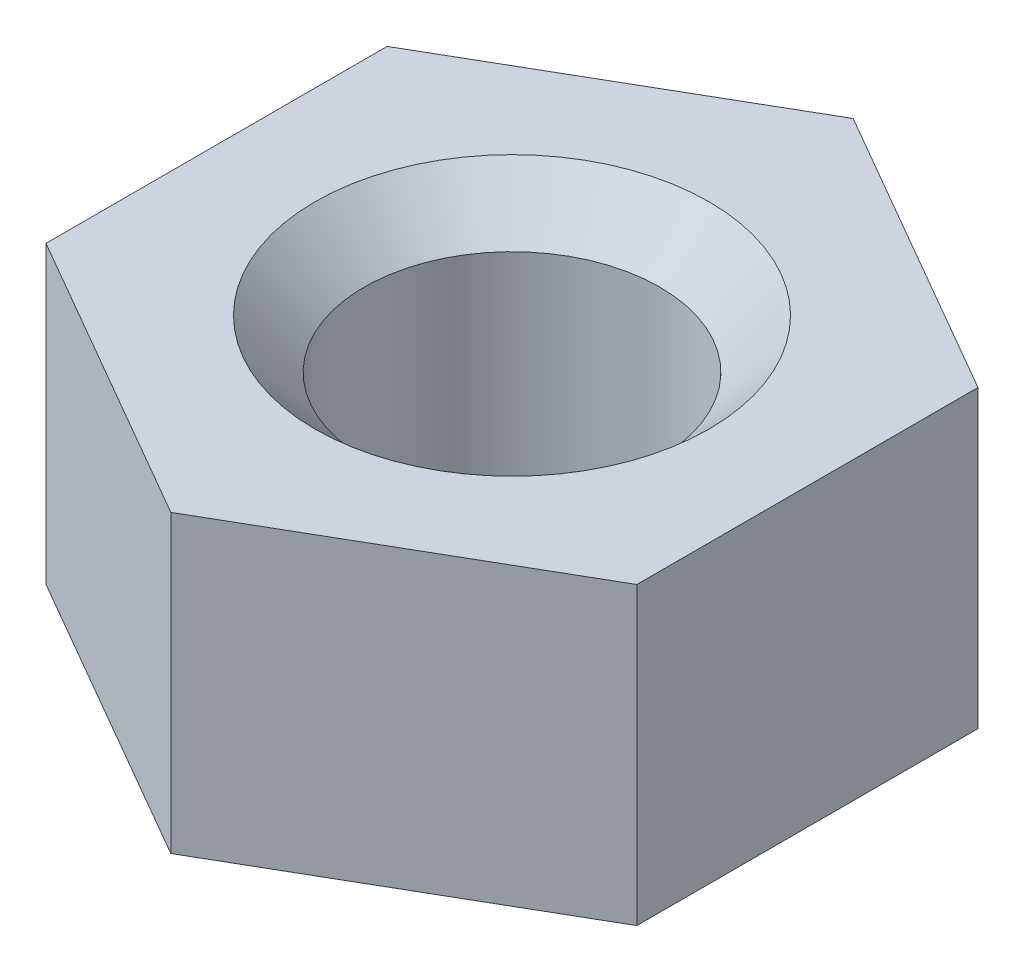
ISO-10303-21;
HEADER;
FILE_DESCRIPTION(('STEP AP214'),'2;1');
FILE_NAME('part.step','',(''),(''),'','','');
FILE_SCHEMA(('AUTOMOTIVE_DESIGN { 1 0 10303 214 1 1 1 1 }'));
ENDSEC;
DATA;
#1=APPLICATION_CONTEXT('core data for automotive mechanical design processes');
#2=APPLICATION_PROTOCOL_DEFINITION('international standard','automotive_design',2000,#1);
#3=PRODUCT_CONTEXT('',#1,'mechanical');
#4=PRODUCT('Part','Part','',(#3));
#5=PRODUCT_RELATED_PRODUCT_CATEGORY('part','',(#4));
#6=PRODUCT_DEFINITION_FORMATION('','',#4);
#7=PRODUCT_DEFINITION_CONTEXT('part definition',#1,'design');
#8=PRODUCT_DEFINITION('design','',#6,#7);
#9=PRODUCT_DEFINITION_SHAPE('','',#8);
#10=(LENGTH_UNIT() NAMED_UNIT(*) SI_UNIT(.MILLI.,.METRE.));
#11=(NAMED_UNIT(*) PLANE_ANGLE_UNIT() SI_UNIT($,.RADIAN.));
#12=(NAMED_UNIT(*) SI_UNIT($,.STERADIAN.) SOLID_ANGLE_UNIT());
#13=UNCERTAINTY_MEASURE_WITH_UNIT(LENGTH_MEASURE(1.E-05),#10,'distance_accuracy_value','');
#14=(GEOMETRIC_REPRESENTATION_CONTEXT(3) GLOBAL_UNCERTAINTY_ASSIGNED_CONTEXT((#13)) GLOBAL_UNIT_ASSIGNED_CONTEXT((#10,
#11,#12)) REPRESENTATION_CONTEXT('',''));
#15=CARTESIAN_POINT('',(0.,0.,0.));
#16=DIRECTION('',(0.,0.,1.));
#17=DIRECTION('',(1.,0.,0.));
#18=AXIS2_PLACEMENT_3D('',#15,#16,#17);
#19=CARTESIAN_POINT('',(5.99999999999996,6.,-3.46410161513783));
#20=DIRECTION('',(-0.499999999999995,0.,0.866025403784441));
#21=DIRECTION('',(0.866025403784442,0.,0.499999999999995));
#22=AXIS2_PLACEMENT_3D('',#19,#20,#21);
#23=PLANE('',#22);
#24=DIRECTION('',(-0.866025403784442,0.,-0.499999999999995));
#25=VECTOR('',#24,1.);
#26=CARTESIAN_POINT('',(5.99999999999996,0.,-3.46410161513783));
#27=LINE('',#26,#25);
#28=CARTESIAN_POINT('',(5.99999999999996,0.,-3.46410161513783));
#29=VERTEX_POINT('',#28);
#30=CARTESIAN_POINT('',(0.,0.,-6.92820323027551));
#31=VERTEX_POINT('',#30);
#32=EDGE_CURVE('E118',#29,#31,#27,.T.);
#33=ORIENTED_EDGE('',*,*,#32,.T.);
#34=DIRECTION('',(0.,-1.,0.));
#35=VECTOR('',#34,1.);
#36=CARTESIAN_POINT('',(0.,6.,-6.92820323027551));
#37=LINE('',#36,#35);
#38=CARTESIAN_POINT('',(0.,6.,-6.92820323027551));
#39=VERTEX_POINT('',#38);
#40=EDGE_CURVE('E135',#39,#31,#37,.T.);
#41=ORIENTED_EDGE('',*,*,#40,.F.);
#42=DIRECTION('',(-0.866025403784442,0.,-0.499999999999995));
#43=VECTOR('',#42,1.);
#44=CARTESIAN_POINT('',(5.99999999999996,6.,-3.46410161513783));
#45=LINE('',#44,#43);
#46=CARTESIAN_POINT('',(5.99999999999996,6.,-3.46410161513783));
#47=VERTEX_POINT('',#46);
#48=EDGE_CURVE('E128',#47,#39,#45,.T.);
#49=ORIENTED_EDGE('',*,*,#48,.F.);
#50=DIRECTION('',(0.,-1.,0.));
#51=VECTOR('',#50,1.);
#52=CARTESIAN_POINT('',(5.99999999999996,6.,-3.46410161513783));
#53=LINE('',#52,#51);
#54=EDGE_CURVE('E114',#47,#29,#53,.T.);
#55=ORIENTED_EDGE('',*,*,#54,.T.);
#56=EDGE_LOOP('',(#33,#41,#49,#55));
#57=FACE_BOUND('',#56,.T.);
#58=ADVANCED_FACE('F32',(#57),#23,.F.);
#59=CARTESIAN_POINT('',(0.,6.,-6.92820323027551));
#60=DIRECTION('',(0.500000000000001,0.,0.866025403784438));
#61=DIRECTION('',(0.866025403784438,0.,-0.500000000000001));
#62=AXIS2_PLACEMENT_3D('',#59,#60,#61);
#63=PLANE('',#62);
#64=DIRECTION('',(-0.866025403784438,0.,0.500000000000001));
#65=VECTOR('',#64,1.);
#66=CARTESIAN_POINT('',(0.,0.,-6.92820323027551));
#67=LINE('',#66,#65);
#68=CARTESIAN_POINT('',(-6.00000000000001,0.,-3.46410161513774));
#69=VERTEX_POINT('',#68);
#70=EDGE_CURVE('E121',#31,#69,#67,.T.);
#71=ORIENTED_EDGE('',*,*,#70,.T.);
#72=DIRECTION('',(0.,-1.,0.));
#73=VECTOR('',#72,1.);
#74=CARTESIAN_POINT('',(-6.00000000000001,6.,-3.46410161513774));
#75=LINE('',#74,#73);
#76=CARTESIAN_POINT('',(-6.00000000000001,6.,-3.46410161513774));
#77=VERTEX_POINT('',#76);
#78=EDGE_CURVE('E132',#77,#69,#75,.T.);
#79=ORIENTED_EDGE('',*,*,#78,.F.);
#80=DIRECTION('',(-0.866025403784438,0.,0.500000000000001));
#81=VECTOR('',#80,1.);
#82=CARTESIAN_POINT('',(0.,6.,-6.92820323027551));
#83=LINE('',#82,#81);
#84=EDGE_CURVE('E87',#39,#77,#83,.T.);
#85=ORIENTED_EDGE('',*,*,#84,.F.);
#86=ORIENTED_EDGE('',*,*,#40,.T.);
#87=EDGE_LOOP('',(#71,#79,#85,#86));
#88=FACE_BOUND('',#87,.T.);
#89=ADVANCED_FACE('F180',(#88),#63,.F.);
#90=CARTESIAN_POINT('',(-6.00000000000001,6.,-3.46410161513774));
#91=DIRECTION('',(1.,0.,0.));
#92=DIRECTION('',(0.,0.,-1.));
#93=AXIS2_PLACEMENT_3D('',#90,#91,#92);
#94=PLANE('',#93);
#95=DIRECTION('',(0.,0.,1.));
#96=VECTOR('',#95,1.);
#97=CARTESIAN_POINT('',(-6.00000000000001,0.,-3.46410161513774));
#98=LINE('',#97,#96);
#99=CARTESIAN_POINT('',(-5.99999999999999,0.,3.46410161513779));
#100=VERTEX_POINT('',#99);
#101=EDGE_CURVE('E123',#69,#100,#98,.T.);
#102=ORIENTED_EDGE('',*,*,#101,.T.);
#103=DIRECTION('',(0.,-1.,0.));
#104=VECTOR('',#103,1.);
#105=CARTESIAN_POINT('',(-5.99999999999999,6.,3.46410161513779));
#106=LINE('',#105,#104);
#107=CARTESIAN_POINT('',(-5.99999999999999,6.,3.46410161513779));
#108=VERTEX_POINT('',#107);
#109=EDGE_CURVE('E109',#108,#100,#106,.T.);
#110=ORIENTED_EDGE('',*,*,#109,.F.);
#111=DIRECTION('',(0.,0.,1.));
#112=VECTOR('',#111,1.);
#113=CARTESIAN_POINT('',(-6.00000000000001,6.,-3.46410161513774));
#114=LINE('',#113,#112);
#115=EDGE_CURVE('E100',#77,#108,#114,.T.);
#116=ORIENTED_EDGE('',*,*,#115,.F.);
#117=ORIENTED_EDGE('',*,*,#78,.T.);
#118=EDGE_LOOP('',(#102,#110,#116,#117));
#119=FACE_BOUND('',#118,.T.);
#120=ADVANCED_FACE('F185',(#119),#94,.F.);
#121=CARTESIAN_POINT('',(-5.99999999999999,6.,3.46410161513779));
#122=DIRECTION('',(0.499999999999995,0.,-0.866025403784441));
#123=DIRECTION('',(-0.866025403784442,0.,-0.499999999999995));
#124=AXIS2_PLACEMENT_3D('',#121,#122,#123);
#125=PLANE('',#124);
#126=DIRECTION('',(0.866025403784442,0.,0.499999999999995));
#127=VECTOR('',#126,1.);
#128=CARTESIAN_POINT('',(-5.99999999999999,0.,3.46410161513779));
#129=LINE('',#128,#127);
#130=CARTESIAN_POINT('',(0.,0.,6.92820323027551));
#131=VERTEX_POINT('',#130);
#132=EDGE_CURVE('E108',#100,#131,#129,.T.);
#133=ORIENTED_EDGE('',*,*,#132,.T.);
#134=DIRECTION('',(0.,-1.,0.));
#135=VECTOR('',#134,1.);
#136=CARTESIAN_POINT('',(0.,6.,6.92820323027551));
#137=LINE('',#136,#135);
#138=CARTESIAN_POINT('',(0.,6.,6.92820323027551));
#139=VERTEX_POINT('',#138);
#140=EDGE_CURVE('E105',#139,#131,#137,.T.);
#141=ORIENTED_EDGE('',*,*,#140,.F.);
#142=DIRECTION('',(0.866025403784442,0.,0.499999999999995));
#143=VECTOR('',#142,1.);
#144=CARTESIAN_POINT('',(-5.99999999999999,6.,3.46410161513779));
#145=LINE('',#144,#143);
#146=EDGE_CURVE('E94',#108,#139,#145,.T.);
#147=ORIENTED_EDGE('',*,*,#146,.F.);
#148=ORIENTED_EDGE('',*,*,#109,.T.);
#149=EDGE_LOOP('',(#133,#141,#147,#148));
#150=FACE_BOUND('',#149,.T.);
#151=ADVANCED_FACE('F106',(#150),#125,.F.);
#152=CARTESIAN_POINT('',(0.,6.,6.92820323027551));
#153=DIRECTION('',(-0.500000000000007,0.,-0.866025403784435));
#154=DIRECTION('',(-0.866025403784434,0.,0.500000000000007));
#155=AXIS2_PLACEMENT_3D('',#152,#153,#154);
#156=PLANE('',#155);
#157=DIRECTION('',(0.866025403784434,0.,-0.500000000000007));
#158=VECTOR('',#157,1.);
#159=CARTESIAN_POINT('',(0.,0.,6.92820323027551));
#160=LINE('',#159,#158);
#161=CARTESIAN_POINT('',(6.00000000000004,0.,3.4641016151377));
#162=VERTEX_POINT('',#161);
#163=EDGE_CURVE('E72',#131,#162,#160,.T.);
#164=ORIENTED_EDGE('',*,*,#163,.T.);
#165=DIRECTION('',(0.,-1.,0.));
#166=VECTOR('',#165,1.);
#167=CARTESIAN_POINT('',(6.00000000000004,6.,3.4641016151377));
#168=LINE('',#167,#166);
#169=CARTESIAN_POINT('',(6.00000000000004,6.,3.4641016151377));
#170=VERTEX_POINT('',#169);
#171=EDGE_CURVE('E110',#170,#162,#168,.T.);
#172=ORIENTED_EDGE('',*,*,#171,.F.);
#173=DIRECTION('',(0.866025403784434,0.,-0.500000000000007));
#174=VECTOR('',#173,1.);
#175=CARTESIAN_POINT('',(0.,6.,6.92820323027551));
#176=LINE('',#175,#174);
#177=EDGE_CURVE('E98',#139,#170,#176,.T.);
#178=ORIENTED_EDGE('',*,*,#177,.F.);
#179=ORIENTED_EDGE('',*,*,#140,.T.);
#180=EDGE_LOOP('',(#164,#172,#178,#179));
#181=FACE_BOUND('',#180,.T.);
#182=ADVANCED_FACE('F112',(#181),#156,.F.);
#183=CARTESIAN_POINT('',(6.00000000000004,6.,3.4641016151377));
#184=DIRECTION('',(-1.,0.,0.));
#185=DIRECTION('',(0.,0.,1.));
#186=AXIS2_PLACEMENT_3D('',#183,#184,#185);
#187=PLANE('',#186);
#188=DIRECTION('',(0.,0.,-1.));
#189=VECTOR('',#188,1.);
#190=CARTESIAN_POINT('',(6.00000000000004,0.,3.4641016151377));
#191=LINE('',#190,#189);
#192=EDGE_CURVE('E78',#162,#29,#191,.T.);
#193=ORIENTED_EDGE('',*,*,#192,.T.);
#194=ORIENTED_EDGE('',*,*,#54,.F.);
#195=DIRECTION('',(0.,0.,-1.));
#196=VECTOR('',#195,1.);
#197=CARTESIAN_POINT('',(6.00000000000004,6.,3.4641016151377));
#198=LINE('',#197,#196);
#199=EDGE_CURVE('E49',#170,#47,#198,.T.);
#200=ORIENTED_EDGE('',*,*,#199,.F.);
#201=ORIENTED_EDGE('',*,*,#171,.T.);
#202=EDGE_LOOP('',(#193,#194,#200,#201));
#203=FACE_BOUND('',#202,.T.);
#204=ADVANCED_FACE('F170',(#203),#187,.F.);
#205=CARTESIAN_POINT('',(0.,6.,0.));
#206=DIRECTION('',(0.,1.,0.));
#207=DIRECTION('',(0.,0.,1.));
#208=AXIS2_PLACEMENT_3D('',#205,#206,#207);
#209=PLANE('',#208);
#210=CARTESIAN_POINT('',(0.,6.,0.));
#211=DIRECTION('',(0.,1.,0.));
#212=DIRECTION('',(0.,0.,1.));
#213=AXIS2_PLACEMENT_3D('',#210,#211,#212);
#214=CIRCLE('',#213,4.);
#215=CARTESIAN_POINT('',(0.,6.,4.));
#216=VERTEX_POINT('',#215);
#217=EDGE_CURVE('E41',#216,#216,#214,.F.);
#218=ORIENTED_EDGE('',*,*,#217,.T.);
#219=EDGE_LOOP('',(#218));
#220=FACE_BOUND('',#219,.T.);
#221=ORIENTED_EDGE('',*,*,#48,.T.);
#222=ORIENTED_EDGE('',*,*,#84,.T.);
#223=ORIENTED_EDGE('',*,*,#115,.T.);
#224=ORIENTED_EDGE('',*,*,#146,.T.);
#225=ORIENTED_EDGE('',*,*,#177,.T.);
#226=ORIENTED_EDGE('',*,*,#199,.T.);
#227=EDGE_LOOP('',(#221,#222,#223,#224,#225,#226));
#228=FACE_BOUND('',#227,.T.);
#229=ADVANCED_FACE('F96',(#220,#228),#209,.T.);
#230=CARTESIAN_POINT('',(0.,0.,0.));
#231=DIRECTION('',(0.,1.,0.));
#232=DIRECTION('',(0.,0.,1.));
#233=AXIS2_PLACEMENT_3D('',#230,#231,#232);
#234=PLANE('',#233);
#235=CARTESIAN_POINT('',(0.,0.,0.));
#236=DIRECTION('',(0.,1.,0.));
#237=DIRECTION('',(0.,0.,1.));
#238=AXIS2_PLACEMENT_3D('',#235,#236,#237);
#239=CIRCLE('',#238,4.);
#240=CARTESIAN_POINT('',(0.,0.,4.));
#241=VERTEX_POINT('',#240);
#242=EDGE_CURVE('E11',#241,#241,#239,.T.);
#243=ORIENTED_EDGE('',*,*,#242,.T.);
#244=EDGE_LOOP('',(#243));
#245=FACE_BOUND('',#244,.T.);
#246=ORIENTED_EDGE('',*,*,#32,.F.);
#247=ORIENTED_EDGE('',*,*,#192,.F.);
#248=ORIENTED_EDGE('',*,*,#163,.F.);
#249=ORIENTED_EDGE('',*,*,#132,.F.);
#250=ORIENTED_EDGE('',*,*,#101,.F.);
#251=ORIENTED_EDGE('',*,*,#70,.F.);
#252=EDGE_LOOP('',(#246,#247,#248,#249,#250,#251));
#253=FACE_BOUND('',#252,.T.);
#254=ADVANCED_FACE('F154',(#245,#253),#234,.F.);
#255=CARTESIAN_POINT('',(0.,0.,0.));
#256=DIRECTION('',(0.,1.,0.));
#257=DIRECTION('',(0.,0.,1.));
#258=AXIS2_PLACEMENT_3D('',#255,#256,#257);
#259=CYLINDRICAL_SURFACE('',#258,3.);
#260=CARTESIAN_POINT('',(0.,5.,0.));
#261=DIRECTION('',(0.,1.,0.));
#262=DIRECTION('',(0.,0.,1.));
#263=AXIS2_PLACEMENT_3D('',#260,#261,#262);
#264=CIRCLE('',#263,3.);
#265=CARTESIAN_POINT('',(0.,5.,3.));
#266=VERTEX_POINT('',#265);
#267=EDGE_CURVE('E140',#266,#266,#264,.T.);
#268=ORIENTED_EDGE('',*,*,#267,.T.);
#269=EDGE_LOOP('',(#268));
#270=FACE_BOUND('',#269,.T.);
#271=CARTESIAN_POINT('',(0.,1.,0.));
#272=DIRECTION('',(0.,1.,0.));
#273=DIRECTION('',(0.,0.,1.));
#274=AXIS2_PLACEMENT_3D('',#271,#272,#273);
#275=CIRCLE('',#274,3.);
#276=CARTESIAN_POINT('',(0.,1.,3.));
#277=VERTEX_POINT('',#276);
#278=EDGE_CURVE('E137',#277,#277,#275,.F.);
#279=ORIENTED_EDGE('',*,*,#278,.T.);
#280=EDGE_LOOP('',(#279));
#281=FACE_BOUND('',#280,.T.);
#282=ADVANCED_FACE('F149',(#270,#281),#259,.F.);
#283=CARTESIAN_POINT('',(0.,5.,0.));
#284=DIRECTION('',(0.,1.,0.));
#285=DIRECTION('',(0.,0.,1.));
#286=AXIS2_PLACEMENT_3D('',#283,#284,#285);
#287=CONICAL_SURFACE('',#286,3.,0.78539816339745);
#288=ORIENTED_EDGE('',*,*,#217,.F.);
#289=EDGE_LOOP('',(#288));
#290=FACE_BOUND('',#289,.T.);
#291=ORIENTED_EDGE('',*,*,#267,.F.);
#292=EDGE_LOOP('',(#291));
#293=FACE_BOUND('',#292,.T.);
#294=ADVANCED_FACE('F146',(#290,#293),#287,.F.);
#295=CARTESIAN_POINT('',(0.,0.,0.));
#296=DIRECTION('',(0.,-1.,0.));
#297=DIRECTION('',(0.,0.,-1.));
#298=AXIS2_PLACEMENT_3D('',#295,#296,#297);
#299=CONICAL_SURFACE('',#298,4.,0.785398163397446);
#300=ORIENTED_EDGE('',*,*,#278,.F.);
#301=EDGE_LOOP('',(#300));
#302=FACE_BOUND('',#301,.T.);
#303=ORIENTED_EDGE('',*,*,#242,.F.);
#304=EDGE_LOOP('',(#303));
#305=FACE_BOUND('',#304,.T.);
#306=ADVANCED_FACE('F34',(#302,#305),#299,.F.);
#307=CLOSED_SHELL('',(#58,#89,#120,#151,#182,#204,#229,#254,#282,#294,#306));
#308=MANIFOLD_SOLID_BREP('B2',#307);
#309=ADVANCED_BREP_SHAPE_REPRESENTATION('',(#18,#308),#14);
#310=SHAPE_DEFINITION_REPRESENTATION(#9,#309);
ENDSEC;
END-ISO-10303-21;
